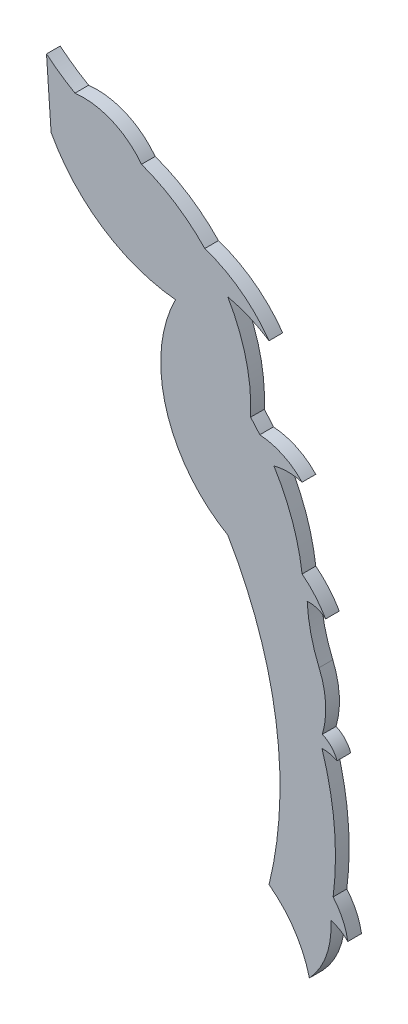
ISO-10303-21;
HEADER;
FILE_DESCRIPTION(('STEP AP214'),'2;1');
FILE_NAME('part.step','',(''),(''),'','','');
FILE_SCHEMA(('AUTOMOTIVE_DESIGN { 1 0 10303 214 1 1 1 1 }'));
ENDSEC;
DATA;
#1=APPLICATION_CONTEXT('core data for automotive mechanical design processes');
#2=APPLICATION_PROTOCOL_DEFINITION('international standard','automotive_design',2000,#1);
#3=PRODUCT_CONTEXT('',#1,'mechanical');
#4=PRODUCT('Part','Part','',(#3));
#5=PRODUCT_RELATED_PRODUCT_CATEGORY('part','',(#4));
#6=PRODUCT_DEFINITION_FORMATION('','',#4);
#7=PRODUCT_DEFINITION_CONTEXT('part definition',#1,'design');
#8=PRODUCT_DEFINITION('design','',#6,#7);
#9=PRODUCT_DEFINITION_SHAPE('','',#8);
#10=(LENGTH_UNIT() NAMED_UNIT(*) SI_UNIT(.MILLI.,.METRE.));
#11=(NAMED_UNIT(*) PLANE_ANGLE_UNIT() SI_UNIT($,.RADIAN.));
#12=(NAMED_UNIT(*) SI_UNIT($,.STERADIAN.) SOLID_ANGLE_UNIT());
#13=UNCERTAINTY_MEASURE_WITH_UNIT(LENGTH_MEASURE(1.E-05),#10,'distance_accuracy_value','');
#14=(GEOMETRIC_REPRESENTATION_CONTEXT(3) GLOBAL_UNCERTAINTY_ASSIGNED_CONTEXT((#13)) GLOBAL_UNIT_ASSIGNED_CONTEXT((#10,
#11,#12)) REPRESENTATION_CONTEXT('',''));
#15=CARTESIAN_POINT('',(0.,0.,0.));
#16=DIRECTION('',(0.,0.,1.));
#17=DIRECTION('',(1.,0.,0.));
#18=AXIS2_PLACEMENT_3D('',#15,#16,#17);
#19=CARTESIAN_POINT('',(-17.3024933003692,110.338418136492,1.524));
#20=DIRECTION('',(0.,0.,-1.));
#21=DIRECTION('',(-1.,0.,0.));
#22=AXIS2_PLACEMENT_3D('',#19,#20,#21);
#23=CYLINDRICAL_SURFACE('',#22,22.4418571303746);
#24=CARTESIAN_POINT('',(-17.3024933003692,110.338418136492,0.));
#25=DIRECTION('',(0.,0.,-1.));
#26=DIRECTION('',(1.,0.,0.));
#27=AXIS2_PLACEMENT_3D('',#24,#25,#26);
#28=CIRCLE('',#27,22.4418571303746);
#29=CARTESIAN_POINT('',(-28.4567762502564,90.8648739461295,0.));
#30=VERTEX_POINT('',#29);
#31=CARTESIAN_POINT('',(-31.6260298544205,93.0620396952532,0.));
#32=VERTEX_POINT('',#31);
#33=EDGE_CURVE('E233',#30,#32,#28,.T.);
#34=ORIENTED_EDGE('',*,*,#33,.T.);
#35=DIRECTION('',(0.,0.,-1.));
#36=VECTOR('',#35,1.);
#37=CARTESIAN_POINT('',(-31.6260298544205,93.0620396952532,1.524));
#38=LINE('',#37,#36);
#39=CARTESIAN_POINT('',(-31.6260298544205,93.0620396952532,1.524));
#40=VERTEX_POINT('',#39);
#41=EDGE_CURVE('E11',#40,#32,#38,.T.);
#42=ORIENTED_EDGE('',*,*,#41,.F.);
#43=CARTESIAN_POINT('',(-17.3024933003692,110.338418136492,1.524));
#44=DIRECTION('',(0.,0.,-1.));
#45=DIRECTION('',(1.,0.,0.));
#46=AXIS2_PLACEMENT_3D('',#43,#44,#45);
#47=CIRCLE('',#46,22.4418571303746);
#48=CARTESIAN_POINT('',(-28.4567762502564,90.8648739461295,1.524));
#49=VERTEX_POINT('',#48);
#50=EDGE_CURVE('E282',#49,#40,#47,.T.);
#51=ORIENTED_EDGE('',*,*,#50,.F.);
#52=DIRECTION('',(0.,0.,-1.));
#53=VECTOR('',#52,1.);
#54=CARTESIAN_POINT('',(-28.4567762502564,90.8648739461295,1.524));
#55=LINE('',#54,#53);
#56=EDGE_CURVE('E229',#49,#30,#55,.T.);
#57=ORIENTED_EDGE('',*,*,#56,.T.);
#58=EDGE_LOOP('',(#34,#42,#51,#57));
#59=FACE_BOUND('',#58,.T.);
#60=ADVANCED_FACE('F35',(#59),#23,.F.);
#61=CARTESIAN_POINT('',(-31.1156545246687,85.7430017860405,1.524));
#62=DIRECTION('',(0.997577515445322,0.0695636448005613,0.));
#63=DIRECTION('',(-0.0695636448005613,0.997577515445322,0.));
#64=AXIS2_PLACEMENT_3D('',#61,#62,#63);
#65=PLANE('',#64);
#66=DIRECTION('',(0.0695636448005613,-0.997577515445322,0.));
#67=VECTOR('',#66,1.);
#68=CARTESIAN_POINT('',(-31.1156545246687,85.7430017860405,0.));
#69=LINE('',#68,#67);
#70=CARTESIAN_POINT('',(-31.1156545246687,85.7430017860405,0.));
#71=VERTEX_POINT('',#70);
#72=EDGE_CURVE('E236',#32,#71,#69,.T.);
#73=ORIENTED_EDGE('',*,*,#72,.T.);
#74=DIRECTION('',(0.,0.,-1.));
#75=VECTOR('',#74,1.);
#76=CARTESIAN_POINT('',(-31.1156545246687,85.7430017860405,1.524));
#77=LINE('',#76,#75);
#78=CARTESIAN_POINT('',(-31.1156545246687,85.7430017860405,1.524));
#79=VERTEX_POINT('',#78);
#80=EDGE_CURVE('E43',#79,#71,#77,.T.);
#81=ORIENTED_EDGE('',*,*,#80,.F.);
#82=DIRECTION('',(0.0695636448005613,-0.997577515445322,0.));
#83=VECTOR('',#82,1.);
#84=CARTESIAN_POINT('',(-31.1156545246687,85.7430017860405,1.524));
#85=LINE('',#84,#83);
#86=EDGE_CURVE('E145',#40,#79,#85,.T.);
#87=ORIENTED_EDGE('',*,*,#86,.F.);
#88=ORIENTED_EDGE('',*,*,#41,.T.);
#89=EDGE_LOOP('',(#73,#81,#87,#88));
#90=FACE_BOUND('',#89,.T.);
#91=ADVANCED_FACE('F425',(#90),#65,.F.);
#92=CARTESIAN_POINT('',(-15.536535131332,94.1502955249123,1.524));
#93=DIRECTION('',(0.,0.,-1.));
#94=DIRECTION('',(-1.,0.,0.));
#95=AXIS2_PLACEMENT_3D('',#92,#93,#94);
#96=CYLINDRICAL_SURFACE('',#95,17.7028683857592);
#97=CARTESIAN_POINT('',(-15.536535131332,94.1502955249123,0.));
#98=DIRECTION('',(0.,0.,1.));
#99=DIRECTION('',(-1.,0.,0.));
#100=AXIS2_PLACEMENT_3D('',#97,#98,#99);
#101=CIRCLE('',#100,17.7028683857592);
#102=CARTESIAN_POINT('',(-17.2533163746224,76.5308684273532,0.));
#103=VERTEX_POINT('',#102);
#104=EDGE_CURVE('E238',#71,#103,#101,.T.);
#105=ORIENTED_EDGE('',*,*,#104,.T.);
#106=DIRECTION('',(0.,0.,-1.));
#107=VECTOR('',#106,1.);
#108=CARTESIAN_POINT('',(-17.2533163746224,76.5308684273532,1.524));
#109=LINE('',#108,#107);
#110=CARTESIAN_POINT('',(-17.2533163746224,76.5308684273532,1.524));
#111=VERTEX_POINT('',#110);
#112=EDGE_CURVE('E340',#111,#103,#109,.T.);
#113=ORIENTED_EDGE('',*,*,#112,.F.);
#114=CARTESIAN_POINT('',(-15.536535131332,94.1502955249123,1.524));
#115=DIRECTION('',(0.,0.,1.));
#116=DIRECTION('',(-1.,0.,0.));
#117=AXIS2_PLACEMENT_3D('',#114,#115,#116);
#118=CIRCLE('',#117,17.7028683857592);
#119=EDGE_CURVE('E348',#79,#111,#118,.T.);
#120=ORIENTED_EDGE('',*,*,#119,.F.);
#121=ORIENTED_EDGE('',*,*,#80,.T.);
#122=EDGE_LOOP('',(#105,#113,#120,#121));
#123=FACE_BOUND('',#122,.T.);
#124=ADVANCED_FACE('F346',(#123),#96,.T.);
#125=CARTESIAN_POINT('',(-3.90752771293424,69.7024363054399,1.524));
#126=DIRECTION('',(0.,0.,-1.));
#127=DIRECTION('',(-1.,0.,0.));
#128=AXIS2_PLACEMENT_3D('',#125,#126,#127);
#129=CYLINDRICAL_SURFACE('',#128,14.9912494557999);
#130=CARTESIAN_POINT('',(-3.90752771293424,69.7024363054399,0.));
#131=DIRECTION('',(0.,0.,1.));
#132=DIRECTION('',(-1.,0.,0.));
#133=AXIS2_PLACEMENT_3D('',#130,#131,#132);
#134=CIRCLE('',#133,14.9912494557999);
#135=CARTESIAN_POINT('',(-11.4344636454671,56.7377613880513,0.));
#136=VERTEX_POINT('',#135);
#137=EDGE_CURVE('E240',#103,#136,#134,.T.);
#138=ORIENTED_EDGE('',*,*,#137,.T.);
#139=DIRECTION('',(0.,0.,-1.));
#140=VECTOR('',#139,1.);
#141=CARTESIAN_POINT('',(-11.4344636454671,56.7377613880513,1.524));
#142=LINE('',#141,#140);
#143=CARTESIAN_POINT('',(-11.4344636454671,56.7377613880513,1.524));
#144=VERTEX_POINT('',#143);
#145=EDGE_CURVE('E337',#144,#136,#142,.T.);
#146=ORIENTED_EDGE('',*,*,#145,.F.);
#147=CARTESIAN_POINT('',(-3.90752771293424,69.7024363054399,1.524));
#148=DIRECTION('',(0.,0.,1.));
#149=DIRECTION('',(-1.,0.,0.));
#150=AXIS2_PLACEMENT_3D('',#147,#148,#149);
#151=CIRCLE('',#150,14.9912494557999);
#152=EDGE_CURVE('E366',#111,#144,#151,.T.);
#153=ORIENTED_EDGE('',*,*,#152,.F.);
#154=ORIENTED_EDGE('',*,*,#112,.T.);
#155=EDGE_LOOP('',(#138,#146,#153,#154));
#156=FACE_BOUND('',#155,.T.);
#157=ADVANCED_FACE('F357',(#156),#129,.T.);
#158=CARTESIAN_POINT('',(-47.7068235865825,35.3788673598282,1.524));
#159=DIRECTION('',(0.,0.,-1.));
#160=DIRECTION('',(-1.,0.,0.));
#161=AXIS2_PLACEMENT_3D('',#158,#159,#160);
#162=CYLINDRICAL_SURFACE('',#161,42.0937816049675);
#163=CARTESIAN_POINT('',(-47.7068235865825,35.3788673598282,0.));
#164=DIRECTION('',(0.,0.,-1.));
#165=DIRECTION('',(1.,0.,0.));
#166=AXIS2_PLACEMENT_3D('',#163,#164,#165);
#167=CIRCLE('',#166,42.0937816049675);
#168=CARTESIAN_POINT('',(-6.8345317639017,25.3119805039865,0.));
#169=VERTEX_POINT('',#168);
#170=EDGE_CURVE('E242',#136,#169,#167,.T.);
#171=ORIENTED_EDGE('',*,*,#170,.T.);
#172=DIRECTION('',(0.,0.,-1.));
#173=VECTOR('',#172,1.);
#174=CARTESIAN_POINT('',(-6.8345317639017,25.3119805039865,1.524));
#175=LINE('',#174,#173);
#176=CARTESIAN_POINT('',(-6.8345317639017,25.3119805039865,1.524));
#177=VERTEX_POINT('',#176);
#178=EDGE_CURVE('E334',#177,#169,#175,.T.);
#179=ORIENTED_EDGE('',*,*,#178,.F.);
#180=CARTESIAN_POINT('',(-47.7068235865825,35.3788673598282,1.524));
#181=DIRECTION('',(0.,0.,-1.));
#182=DIRECTION('',(1.,0.,0.));
#183=AXIS2_PLACEMENT_3D('',#180,#181,#182);
#184=CIRCLE('',#183,42.0937816049675);
#185=EDGE_CURVE('E363',#144,#177,#184,.T.);
#186=ORIENTED_EDGE('',*,*,#185,.F.);
#187=ORIENTED_EDGE('',*,*,#145,.T.);
#188=EDGE_LOOP('',(#171,#179,#186,#187));
#189=FACE_BOUND('',#188,.T.);
#190=ADVANCED_FACE('F361',(#189),#162,.F.);
#191=CARTESIAN_POINT('',(-13.9944501828131,15.6771297998431,1.524));
#192=DIRECTION('',(0.,0.,-1.));
#193=DIRECTION('',(-1.,0.,0.));
#194=AXIS2_PLACEMENT_3D('',#191,#192,#193);
#195=CYLINDRICAL_SURFACE('',#194,12.0039485110775);
#196=CARTESIAN_POINT('',(-13.9944501828131,15.6771297998431,0.));
#197=DIRECTION('',(0.,0.,-1.));
#198=DIRECTION('',(1.,0.,0.));
#199=AXIS2_PLACEMENT_3D('',#196,#197,#198);
#200=CIRCLE('',#199,12.0039485110775);
#201=CARTESIAN_POINT('',(-2.33938911909727,18.5501650341649,0.));
#202=VERTEX_POINT('',#201);
#203=EDGE_CURVE('E244',#169,#202,#200,.T.);
#204=ORIENTED_EDGE('',*,*,#203,.T.);
#205=DIRECTION('',(0.,0.,-1.));
#206=VECTOR('',#205,1.);
#207=CARTESIAN_POINT('',(-2.33938911909727,18.5501650341649,1.524));
#208=LINE('',#207,#206);
#209=CARTESIAN_POINT('',(-2.33938911909727,18.5501650341649,1.524));
#210=VERTEX_POINT('',#209);
#211=EDGE_CURVE('E331',#210,#202,#208,.T.);
#212=ORIENTED_EDGE('',*,*,#211,.F.);
#213=CARTESIAN_POINT('',(-13.9944501828131,15.6771297998431,1.524));
#214=DIRECTION('',(0.,0.,-1.));
#215=DIRECTION('',(1.,0.,0.));
#216=AXIS2_PLACEMENT_3D('',#213,#214,#215);
#217=CIRCLE('',#216,12.0039485110775);
#218=EDGE_CURVE('E365',#177,#210,#217,.T.);
#219=ORIENTED_EDGE('',*,*,#218,.F.);
#220=ORIENTED_EDGE('',*,*,#178,.T.);
#221=EDGE_LOOP('',(#204,#212,#219,#220));
#222=FACE_BOUND('',#221,.T.);
#223=ADVANCED_FACE('F438',(#222),#195,.F.);
#224=CARTESIAN_POINT('',(-8.89107414495909,24.6666613876007,1.524));
#225=DIRECTION('',(0.,0.,-1.));
#226=DIRECTION('',(-1.,0.,0.));
#227=AXIS2_PLACEMENT_3D('',#224,#225,#226);
#228=CYLINDRICAL_SURFACE('',#227,8.96304101963696);
#229=CARTESIAN_POINT('',(-8.89107414495909,24.6666613876007,0.));
#230=DIRECTION('',(0.,0.,1.));
#231=DIRECTION('',(-1.,0.,0.));
#232=AXIS2_PLACEMENT_3D('',#229,#230,#231);
#233=CIRCLE('',#232,8.96304101963696);
#234=CARTESIAN_POINT('',(0.0487059170850342,25.3119805039865,0.));
#235=VERTEX_POINT('',#234);
#236=EDGE_CURVE('E246',#202,#235,#233,.T.);
#237=ORIENTED_EDGE('',*,*,#236,.T.);
#238=DIRECTION('',(0.,0.,-1.));
#239=VECTOR('',#238,1.);
#240=CARTESIAN_POINT('',(0.0487059170850342,25.3119805039865,1.524));
#241=LINE('',#240,#239);
#242=CARTESIAN_POINT('',(0.0487059170850342,25.3119805039865,1.524));
#243=VERTEX_POINT('',#242);
#244=EDGE_CURVE('E328',#243,#235,#241,.T.);
#245=ORIENTED_EDGE('',*,*,#244,.F.);
#246=CARTESIAN_POINT('',(-8.89107414495909,24.6666613876007,1.524));
#247=DIRECTION('',(0.,0.,1.));
#248=DIRECTION('',(-1.,0.,0.));
#249=AXIS2_PLACEMENT_3D('',#246,#247,#248);
#250=CIRCLE('',#249,8.96304101963696);
#251=EDGE_CURVE('E368',#210,#243,#250,.T.);
#252=ORIENTED_EDGE('',*,*,#251,.F.);
#253=ORIENTED_EDGE('',*,*,#211,.T.);
#254=EDGE_LOOP('',(#237,#245,#252,#253));
#255=FACE_BOUND('',#254,.T.);
#256=ADVANCED_FACE('F441',(#255),#228,.T.);
#257=CARTESIAN_POINT('',(-1.01856859330376,21.3075940898435,1.524));
#258=DIRECTION('',(0.,0.,-1.));
#259=DIRECTION('',(-1.,0.,0.));
#260=AXIS2_PLACEMENT_3D('',#257,#258,#259);
#261=CYLINDRICAL_SURFACE('',#260,4.14417487979197);
#262=CARTESIAN_POINT('',(-1.01856859330376,21.3075940898435,0.));
#263=DIRECTION('',(0.,0.,-1.));
#264=DIRECTION('',(1.,0.,0.));
#265=AXIS2_PLACEMENT_3D('',#262,#263,#264);
#266=CIRCLE('',#265,4.14417487979197);
#267=CARTESIAN_POINT('',(1.94072364464759,24.2087619382624,0.));
#268=VERTEX_POINT('',#267);
#269=EDGE_CURVE('E248',#235,#268,#266,.T.);
#270=ORIENTED_EDGE('',*,*,#269,.T.);
#271=DIRECTION('',(0.,0.,-1.));
#272=VECTOR('',#271,1.);
#273=CARTESIAN_POINT('',(1.94072364464759,24.2087619382624,1.524));
#274=LINE('',#273,#272);
#275=CARTESIAN_POINT('',(1.94072364464759,24.2087619382624,1.524));
#276=VERTEX_POINT('',#275);
#277=EDGE_CURVE('E325',#276,#268,#274,.T.);
#278=ORIENTED_EDGE('',*,*,#277,.F.);
#279=CARTESIAN_POINT('',(-1.01856859330376,21.3075940898435,1.524));
#280=DIRECTION('',(0.,0.,-1.));
#281=DIRECTION('',(1.,0.,0.));
#282=AXIS2_PLACEMENT_3D('',#279,#280,#281);
#283=CIRCLE('',#282,4.14417487979197);
#284=EDGE_CURVE('E374',#243,#276,#283,.T.);
#285=ORIENTED_EDGE('',*,*,#284,.F.);
#286=ORIENTED_EDGE('',*,*,#244,.T.);
#287=EDGE_LOOP('',(#270,#278,#285,#286));
#288=FACE_BOUND('',#287,.T.);
#289=ADVANCED_FACE('F445',(#288),#261,.F.);
#290=CARTESIAN_POINT('',(-5.07908944021825,23.0362233272412,1.524));
#291=DIRECTION('',(0.,0.,-1.));
#292=DIRECTION('',(-1.,0.,0.));
#293=AXIS2_PLACEMENT_3D('',#290,#291,#292);
#294=CYLINDRICAL_SURFACE('',#293,7.11706558497174);
#295=CARTESIAN_POINT('',(-5.07908944021825,23.0362233272412,0.));
#296=DIRECTION('',(0.,0.,1.));
#297=DIRECTION('',(-1.,0.,0.));
#298=AXIS2_PLACEMENT_3D('',#295,#296,#297);
#299=CIRCLE('',#298,7.11706558497174);
#300=CARTESIAN_POINT('',(0.303865797754205,27.692017077696,0.));
#301=VERTEX_POINT('',#300);
#302=EDGE_CURVE('E250',#268,#301,#299,.T.);
#303=ORIENTED_EDGE('',*,*,#302,.T.);
#304=DIRECTION('',(0.,0.,-1.));
#305=VECTOR('',#304,1.);
#306=CARTESIAN_POINT('',(0.303865797754205,27.692017077696,1.524));
#307=LINE('',#306,#305);
#308=CARTESIAN_POINT('',(0.303865797754205,27.692017077696,1.524));
#309=VERTEX_POINT('',#308);
#310=EDGE_CURVE('E322',#309,#301,#307,.T.);
#311=ORIENTED_EDGE('',*,*,#310,.F.);
#312=CARTESIAN_POINT('',(-5.07908944021825,23.0362233272412,1.524));
#313=DIRECTION('',(0.,0.,1.));
#314=DIRECTION('',(-1.,0.,0.));
#315=AXIS2_PLACEMENT_3D('',#312,#313,#314);
#316=CIRCLE('',#315,7.11706558497174);
#317=EDGE_CURVE('E376',#276,#309,#316,.T.);
#318=ORIENTED_EDGE('',*,*,#317,.F.);
#319=ORIENTED_EDGE('',*,*,#277,.T.);
#320=EDGE_LOOP('',(#303,#311,#318,#319));
#321=FACE_BOUND('',#320,.T.);
#322=ADVANCED_FACE('F449',(#321),#294,.T.);
#323=CARTESIAN_POINT('',(-31.0648704485611,31.7601799505042,1.524));
#324=DIRECTION('',(0.,0.,-1.));
#325=DIRECTION('',(-1.,0.,0.));
#326=AXIS2_PLACEMENT_3D('',#323,#324,#325);
#327=CYLINDRICAL_SURFACE('',#326,31.6314331456953);
#328=CARTESIAN_POINT('',(-31.0648704485611,31.7601799505042,0.));
#329=DIRECTION('',(0.,0.,1.));
#330=DIRECTION('',(-1.,0.,0.));
#331=AXIS2_PLACEMENT_3D('',#328,#329,#330);
#332=CIRCLE('',#331,31.6314331456953);
#333=CARTESIAN_POINT('',(-0.941146572103171,41.4094712543,0.));
#334=VERTEX_POINT('',#333);
#335=EDGE_CURVE('E252',#301,#334,#332,.T.);
#336=ORIENTED_EDGE('',*,*,#335,.T.);
#337=DIRECTION('',(0.,0.,-1.));
#338=VECTOR('',#337,1.);
#339=CARTESIAN_POINT('',(-0.941146572103171,41.4094712543,1.524));
#340=LINE('',#339,#338);
#341=CARTESIAN_POINT('',(-0.941146572103171,41.4094712543,1.524));
#342=VERTEX_POINT('',#341);
#343=EDGE_CURVE('E319',#342,#334,#340,.T.);
#344=ORIENTED_EDGE('',*,*,#343,.F.);
#345=CARTESIAN_POINT('',(-31.0648704485611,31.7601799505042,1.524));
#346=DIRECTION('',(0.,0.,1.));
#347=DIRECTION('',(-1.,0.,0.));
#348=AXIS2_PLACEMENT_3D('',#345,#346,#347);
#349=CIRCLE('',#348,31.6314331456953);
#350=EDGE_CURVE('E378',#309,#342,#349,.T.);
#351=ORIENTED_EDGE('',*,*,#350,.F.);
#352=ORIENTED_EDGE('',*,*,#310,.T.);
#353=EDGE_LOOP('',(#336,#344,#351,#352));
#354=FACE_BOUND('',#353,.T.);
#355=ADVANCED_FACE('F453',(#354),#327,.T.);
#356=CARTESIAN_POINT('',(-0.893428223070229,37.5181940332144,1.524));
#357=DIRECTION('',(0.,0.,-1.));
#358=DIRECTION('',(-1.,0.,0.));
#359=AXIS2_PLACEMENT_3D('',#356,#357,#358);
#360=CYLINDRICAL_SURFACE('',#359,3.89156979279235);
#361=CARTESIAN_POINT('',(-0.893428223070229,37.5181940332144,0.));
#362=DIRECTION('',(0.,0.,-1.));
#363=DIRECTION('',(1.,0.,0.));
#364=AXIS2_PLACEMENT_3D('',#361,#362,#363);
#365=CIRCLE('',#364,3.89156979279235);
#366=CARTESIAN_POINT('',(0.742668625515866,41.049129115345,0.));
#367=VERTEX_POINT('',#366);
#368=EDGE_CURVE('E254',#334,#367,#365,.T.);
#369=ORIENTED_EDGE('',*,*,#368,.T.);
#370=DIRECTION('',(0.,0.,-1.));
#371=VECTOR('',#370,1.);
#372=CARTESIAN_POINT('',(0.742668625515866,41.049129115345,1.524));
#373=LINE('',#372,#371);
#374=CARTESIAN_POINT('',(0.742668625515866,41.049129115345,1.524));
#375=VERTEX_POINT('',#374);
#376=EDGE_CURVE('E316',#375,#367,#373,.T.);
#377=ORIENTED_EDGE('',*,*,#376,.F.);
#378=CARTESIAN_POINT('',(-0.893428223070229,37.5181940332144,1.524));
#379=DIRECTION('',(0.,0.,-1.));
#380=DIRECTION('',(1.,0.,0.));
#381=AXIS2_PLACEMENT_3D('',#378,#379,#380);
#382=CIRCLE('',#381,3.89156979279235);
#383=EDGE_CURVE('E380',#342,#375,#382,.T.);
#384=ORIENTED_EDGE('',*,*,#383,.F.);
#385=ORIENTED_EDGE('',*,*,#343,.T.);
#386=EDGE_LOOP('',(#369,#377,#384,#385));
#387=FACE_BOUND('',#386,.T.);
#388=ADVANCED_FACE('F457',(#387),#360,.F.);
#389=CARTESIAN_POINT('',(-2.1273885005661,39.977980042309,1.524));
#390=DIRECTION('',(0.,0.,-1.));
#391=DIRECTION('',(-1.,0.,0.));
#392=AXIS2_PLACEMENT_3D('',#389,#390,#391);
#393=CYLINDRICAL_SURFACE('',#392,3.06342753197131);
#394=CARTESIAN_POINT('',(-2.1273885005661,39.977980042309,0.));
#395=DIRECTION('',(0.,0.,1.));
#396=DIRECTION('',(-1.,0.,0.));
#397=AXIS2_PLACEMENT_3D('',#394,#395,#396);
#398=CIRCLE('',#397,3.06342753197131);
#399=CARTESIAN_POINT('',(-0.893428223070066,42.7818934284894,0.));
#400=VERTEX_POINT('',#399);
#401=EDGE_CURVE('E256',#367,#400,#398,.T.);
#402=ORIENTED_EDGE('',*,*,#401,.T.);
#403=DIRECTION('',(0.,0.,-1.));
#404=VECTOR('',#403,1.);
#405=CARTESIAN_POINT('',(-0.893428223070066,42.7818934284894,1.524));
#406=LINE('',#405,#404);
#407=CARTESIAN_POINT('',(-0.893428223070066,42.7818934284894,1.524));
#408=VERTEX_POINT('',#407);
#409=EDGE_CURVE('E313',#408,#400,#406,.T.);
#410=ORIENTED_EDGE('',*,*,#409,.F.);
#411=CARTESIAN_POINT('',(-2.1273885005661,39.977980042309,1.524));
#412=DIRECTION('',(0.,0.,1.));
#413=DIRECTION('',(-1.,0.,0.));
#414=AXIS2_PLACEMENT_3D('',#411,#412,#413);
#415=CIRCLE('',#414,3.06342753197131);
#416=EDGE_CURVE('E382',#375,#408,#415,.T.);
#417=ORIENTED_EDGE('',*,*,#416,.F.);
#418=ORIENTED_EDGE('',*,*,#376,.T.);
#419=EDGE_LOOP('',(#402,#410,#417,#418));
#420=FACE_BOUND('',#419,.T.);
#421=ADVANCED_FACE('F461',(#420),#393,.T.);
#422=CARTESIAN_POINT('',(-9.77457463909335,45.397743851005,1.524));
#423=DIRECTION('',(0.,0.,-1.));
#424=DIRECTION('',(-1.,0.,0.));
#425=AXIS2_PLACEMENT_3D('',#422,#423,#424);
#426=CYLINDRICAL_SURFACE('',#425,9.25837108220547);
#427=CARTESIAN_POINT('',(-9.77457463909335,45.397743851005,0.));
#428=DIRECTION('',(0.,0.,1.));
#429=DIRECTION('',(-1.,0.,0.));
#430=AXIS2_PLACEMENT_3D('',#427,#428,#429);
#431=CIRCLE('',#430,9.25837108220547);
#432=CARTESIAN_POINT('',(-1.25852369652675,49.0301413291769,0.));
#433=VERTEX_POINT('',#432);
#434=EDGE_CURVE('E258',#400,#433,#431,.T.);
#435=ORIENTED_EDGE('',*,*,#434,.T.);
#436=DIRECTION('',(0.,0.,-1.));
#437=VECTOR('',#436,1.);
#438=CARTESIAN_POINT('',(-1.25852369652675,49.0301413291769,1.524));
#439=LINE('',#438,#437);
#440=CARTESIAN_POINT('',(-1.25852369652675,49.0301413291769,1.524));
#441=VERTEX_POINT('',#440);
#442=EDGE_CURVE('E310',#441,#433,#439,.T.);
#443=ORIENTED_EDGE('',*,*,#442,.F.);
#444=CARTESIAN_POINT('',(-9.77457463909335,45.397743851005,1.524));
#445=DIRECTION('',(0.,0.,1.));
#446=DIRECTION('',(-1.,0.,0.));
#447=AXIS2_PLACEMENT_3D('',#444,#445,#446);
#448=CIRCLE('',#447,9.25837108220547);
#449=EDGE_CURVE('E384',#408,#441,#448,.T.);
#450=ORIENTED_EDGE('',*,*,#449,.F.);
#451=ORIENTED_EDGE('',*,*,#409,.T.);
#452=EDGE_LOOP('',(#435,#443,#450,#451));
#453=FACE_BOUND('',#452,.T.);
#454=ADVANCED_FACE('F465',(#453),#426,.T.);
#455=CARTESIAN_POINT('',(14.2045890021924,55.625706803161,1.524));
#456=DIRECTION('',(0.,0.,-1.));
#457=DIRECTION('',(-1.,0.,0.));
#458=AXIS2_PLACEMENT_3D('',#455,#456,#457);
#459=CYLINDRICAL_SURFACE('',#458,16.8109886162269);
#460=CARTESIAN_POINT('',(14.2045890021924,55.625706803161,0.));
#461=DIRECTION('',(0.,0.,-1.));
#462=DIRECTION('',(1.,0.,0.));
#463=AXIS2_PLACEMENT_3D('',#460,#461,#462);
#464=CIRCLE('',#463,16.8109886162269);
#465=CARTESIAN_POINT('',(-2.58443242218058,54.7665805802723,0.));
#466=VERTEX_POINT('',#465);
#467=EDGE_CURVE('E261',#433,#466,#464,.T.);
#468=ORIENTED_EDGE('',*,*,#467,.T.);
#469=DIRECTION('',(0.,0.,-1.));
#470=VECTOR('',#469,1.);
#471=CARTESIAN_POINT('',(-2.58443242218058,54.7665805802723,1.524));
#472=LINE('',#471,#470);
#473=CARTESIAN_POINT('',(-2.58443242218058,54.7665805802723,1.524));
#474=VERTEX_POINT('',#473);
#475=EDGE_CURVE('E307',#474,#466,#472,.T.);
#476=ORIENTED_EDGE('',*,*,#475,.F.);
#477=CARTESIAN_POINT('',(14.2045890021717,55.6257068031559,1.524));
#478=DIRECTION('',(0.,0.,-1.));
#479=DIRECTION('',(1.,0.,0.));
#480=AXIS2_PLACEMENT_3D('',#477,#478,#479);
#481=CIRCLE('',#480,16.8109886162056);
#482=EDGE_CURVE('E386',#441,#474,#481,.T.);
#483=ORIENTED_EDGE('',*,*,#482,.F.);
#484=ORIENTED_EDGE('',*,*,#442,.T.);
#485=EDGE_LOOP('',(#468,#476,#483,#484));
#486=FACE_BOUND('',#485,.T.);
#487=ADVANCED_FACE('F469',(#486),#459,.F.);
#488=CARTESIAN_POINT('',(-2.31316757840683,52.1359332619856,1.524));
#489=DIRECTION('',(0.,0.,-1.));
#490=DIRECTION('',(-1.,0.,0.));
#491=AXIS2_PLACEMENT_3D('',#488,#489,#490);
#492=CYLINDRICAL_SURFACE('',#491,2.64459636403676);
#493=CARTESIAN_POINT('',(-2.31316757840683,52.1359332619856,0.));
#494=DIRECTION('',(0.,0.,-1.));
#495=DIRECTION('',(1.,0.,0.));
#496=AXIS2_PLACEMENT_3D('',#493,#494,#495);
#497=CIRCLE('',#496,2.64459636403676);
#498=CARTESIAN_POINT('',(-0.531968435184138,54.090727251351,0.));
#499=VERTEX_POINT('',#498);
#500=EDGE_CURVE('E263',#466,#499,#497,.T.);
#501=ORIENTED_EDGE('',*,*,#500,.T.);
#502=DIRECTION('',(0.,0.,-1.));
#503=VECTOR('',#502,1.);
#504=CARTESIAN_POINT('',(-0.531968435184138,54.090727251351,1.524));
#505=LINE('',#504,#503);
#506=CARTESIAN_POINT('',(-0.531968435184138,54.090727251351,1.524));
#507=VERTEX_POINT('',#506);
#508=EDGE_CURVE('E304',#507,#499,#505,.T.);
#509=ORIENTED_EDGE('',*,*,#508,.F.);
#510=CARTESIAN_POINT('',(-2.31316757840683,52.1359332619856,1.524));
#511=DIRECTION('',(0.,0.,-1.));
#512=DIRECTION('',(1.,0.,0.));
#513=AXIS2_PLACEMENT_3D('',#510,#511,#512);
#514=CIRCLE('',#513,2.64459636403676);
#515=EDGE_CURVE('E388',#474,#507,#514,.T.);
#516=ORIENTED_EDGE('',*,*,#515,.F.);
#517=ORIENTED_EDGE('',*,*,#475,.T.);
#518=EDGE_LOOP('',(#501,#509,#516,#517));
#519=FACE_BOUND('',#518,.T.);
#520=ADVANCED_FACE('F473',(#519),#492,.F.);
#521=CARTESIAN_POINT('',(-9.64317433097189,48.8594499835328,1.524));
#522=DIRECTION('',(0.,0.,-1.));
#523=DIRECTION('',(-1.,0.,0.));
#524=AXIS2_PLACEMENT_3D('',#521,#522,#523);
#525=CYLINDRICAL_SURFACE('',#524,10.5062045824469);
#526=CARTESIAN_POINT('',(-9.64317433097189,48.8594499835328,0.));
#527=DIRECTION('',(0.,0.,1.));
#528=DIRECTION('',(-1.,0.,0.));
#529=AXIS2_PLACEMENT_3D('',#526,#527,#528);
#530=CIRCLE('',#529,10.5062045824469);
#531=CARTESIAN_POINT('',(-3.15070988526024,57.1194887334055,0.));
#532=VERTEX_POINT('',#531);
#533=EDGE_CURVE('E265',#499,#532,#530,.T.);
#534=ORIENTED_EDGE('',*,*,#533,.T.);
#535=DIRECTION('',(0.,0.,-1.));
#536=VECTOR('',#535,1.);
#537=CARTESIAN_POINT('',(-3.15070988526024,57.1194887334055,1.524));
#538=LINE('',#537,#536);
#539=CARTESIAN_POINT('',(-3.15070988526024,57.1194887334055,1.524));
#540=VERTEX_POINT('',#539);
#541=EDGE_CURVE('E301',#540,#532,#538,.T.);
#542=ORIENTED_EDGE('',*,*,#541,.F.);
#543=CARTESIAN_POINT('',(-9.64317433097189,48.8594499835328,1.524));
#544=DIRECTION('',(0.,0.,1.));
#545=DIRECTION('',(-1.,0.,0.));
#546=AXIS2_PLACEMENT_3D('',#543,#544,#545);
#547=CIRCLE('',#546,10.5062045824469);
#548=EDGE_CURVE('E390',#507,#540,#547,.T.);
#549=ORIENTED_EDGE('',*,*,#548,.F.);
#550=ORIENTED_EDGE('',*,*,#508,.T.);
#551=EDGE_LOOP('',(#534,#542,#549,#550));
#552=FACE_BOUND('',#551,.T.);
#553=ADVANCED_FACE('F477',(#552),#525,.T.);
#554=CARTESIAN_POINT('',(-25.0332112363326,54.3458278928265,1.524));
#555=DIRECTION('',(0.,0.,-1.));
#556=DIRECTION('',(-1.,0.,0.));
#557=AXIS2_PLACEMENT_3D('',#554,#555,#556);
#558=CYLINDRICAL_SURFACE('',#557,22.0575850862746);
#559=CARTESIAN_POINT('',(-25.0332112363326,54.3458278928265,0.));
#560=DIRECTION('',(0.,0.,1.));
#561=DIRECTION('',(-1.,0.,0.));
#562=AXIS2_PLACEMENT_3D('',#559,#560,#561);
#563=CIRCLE('',#562,22.0575850862746);
#564=CARTESIAN_POINT('',(-6.291364356868,65.9768310905282,0.));
#565=VERTEX_POINT('',#564);
#566=EDGE_CURVE('E267',#532,#565,#563,.T.);
#567=ORIENTED_EDGE('',*,*,#566,.T.);
#568=DIRECTION('',(0.,0.,-1.));
#569=VECTOR('',#568,1.);
#570=CARTESIAN_POINT('',(-6.291364356868,65.9768310905282,1.524));
#571=LINE('',#570,#569);
#572=CARTESIAN_POINT('',(-6.291364356868,65.9768310905282,1.524));
#573=VERTEX_POINT('',#572);
#574=EDGE_CURVE('E298',#573,#565,#571,.T.);
#575=ORIENTED_EDGE('',*,*,#574,.F.);
#576=CARTESIAN_POINT('',(-25.0332112363326,54.3458278928265,1.524));
#577=DIRECTION('',(0.,0.,1.));
#578=DIRECTION('',(-1.,0.,0.));
#579=AXIS2_PLACEMENT_3D('',#576,#577,#578);
#580=CIRCLE('',#579,22.0575850862746);
#581=EDGE_CURVE('E392',#540,#573,#580,.T.);
#582=ORIENTED_EDGE('',*,*,#581,.F.);
#583=ORIENTED_EDGE('',*,*,#541,.T.);
#584=EDGE_LOOP('',(#567,#575,#582,#583));
#585=FACE_BOUND('',#584,.T.);
#586=ADVANCED_FACE('F481',(#585),#558,.T.);
#587=CARTESIAN_POINT('',(-4.72103712106412,60.2455165620382,1.524));
#588=DIRECTION('',(0.,0.,-1.));
#589=DIRECTION('',(-1.,0.,0.));
#590=AXIS2_PLACEMENT_3D('',#587,#588,#589);
#591=CYLINDRICAL_SURFACE('',#590,5.94254944043283);
#592=CARTESIAN_POINT('',(-4.72103712106412,60.2455165620382,0.));
#593=DIRECTION('',(0.,0.,-1.));
#594=DIRECTION('',(1.,0.,0.));
#595=AXIS2_PLACEMENT_3D('',#592,#593,#594);
#596=CIRCLE('',#595,5.94254944043283);
#597=CARTESIAN_POINT('',(-3.15070988526024,65.9768310905282,0.));
#598=VERTEX_POINT('',#597);
#599=EDGE_CURVE('E269',#565,#598,#596,.T.);
#600=ORIENTED_EDGE('',*,*,#599,.T.);
#601=DIRECTION('',(0.,0.,-1.));
#602=VECTOR('',#601,1.);
#603=CARTESIAN_POINT('',(-3.15070988526024,65.9768310905282,1.524));
#604=LINE('',#603,#602);
#605=CARTESIAN_POINT('',(-3.15070988526024,65.9768310905282,1.524));
#606=VERTEX_POINT('',#605);
#607=EDGE_CURVE('E295',#606,#598,#604,.T.);
#608=ORIENTED_EDGE('',*,*,#607,.F.);
#609=CARTESIAN_POINT('',(-4.72103712106412,60.2455165620382,1.524));
#610=DIRECTION('',(0.,0.,-1.));
#611=DIRECTION('',(1.,0.,0.));
#612=AXIS2_PLACEMENT_3D('',#609,#610,#611);
#613=CIRCLE('',#612,5.94254944043283);
#614=EDGE_CURVE('E394',#573,#606,#613,.T.);
#615=ORIENTED_EDGE('',*,*,#614,.F.);
#616=ORIENTED_EDGE('',*,*,#574,.T.);
#617=EDGE_LOOP('',(#600,#608,#615,#616));
#618=FACE_BOUND('',#617,.T.);
#619=ADVANCED_FACE('F485',(#618),#591,.F.);
#620=CARTESIAN_POINT('',(-8.33418737302962,61.0836940188721,1.524));
#621=DIRECTION('',(0.,0.,-1.));
#622=DIRECTION('',(-1.,0.,0.));
#623=AXIS2_PLACEMENT_3D('',#620,#621,#622);
#624=CYLINDRICAL_SURFACE('',#623,7.12819958111634);
#625=CARTESIAN_POINT('',(-8.33418737302962,61.0836940188721,0.));
#626=DIRECTION('',(0.,0.,1.));
#627=DIRECTION('',(-1.,0.,0.));
#628=AXIS2_PLACEMENT_3D('',#625,#626,#627);
#629=CIRCLE('',#628,7.12819958111634);
#630=CARTESIAN_POINT('',(-7.86653028454092,68.1965363562091,0.));
#631=VERTEX_POINT('',#630);
#632=EDGE_CURVE('E271',#598,#631,#629,.T.);
#633=ORIENTED_EDGE('',*,*,#632,.T.);
#634=DIRECTION('',(0.,0.,-1.));
#635=VECTOR('',#634,1.);
#636=CARTESIAN_POINT('',(-7.86653028454092,68.1965363562091,1.524));
#637=LINE('',#636,#635);
#638=CARTESIAN_POINT('',(-7.86653028454092,68.1965363562091,1.524));
#639=VERTEX_POINT('',#638);
#640=EDGE_CURVE('E292',#639,#631,#637,.T.);
#641=ORIENTED_EDGE('',*,*,#640,.F.);
#642=CARTESIAN_POINT('',(-8.33418737302962,61.0836940188721,1.524));
#643=DIRECTION('',(0.,0.,1.));
#644=DIRECTION('',(-1.,0.,0.));
#645=AXIS2_PLACEMENT_3D('',#642,#643,#644);
#646=CIRCLE('',#645,7.12819958111634);
#647=EDGE_CURVE('E396',#606,#639,#646,.T.);
#648=ORIENTED_EDGE('',*,*,#647,.F.);
#649=ORIENTED_EDGE('',*,*,#607,.T.);
#650=EDGE_LOOP('',(#633,#641,#648,#649));
#651=FACE_BOUND('',#650,.T.);
#652=ADVANCED_FACE('F489',(#651),#624,.T.);
#653=CARTESIAN_POINT('',(-25.0332112363658,54.3458278927917,1.524));
#654=DIRECTION('',(0.,0.,-1.));
#655=DIRECTION('',(-1.,0.,0.));
#656=AXIS2_PLACEMENT_3D('',#653,#654,#655);
#657=CYLINDRICAL_SURFACE('',#656,22.0575850863219);
#658=CARTESIAN_POINT('',(-25.0332112363658,54.3458278927917,0.));
#659=DIRECTION('',(0.,0.,1.));
#660=DIRECTION('',(-1.,0.,0.));
#661=AXIS2_PLACEMENT_3D('',#658,#659,#660);
#662=CIRCLE('',#661,22.0575850863219);
#663=CARTESIAN_POINT('',(-8.89107414495884,69.3780755611397,0.));
#664=VERTEX_POINT('',#663);
#665=EDGE_CURVE('E273',#631,#664,#662,.T.);
#666=ORIENTED_EDGE('',*,*,#665,.T.);
#667=DIRECTION('',(0.,0.,-1.));
#668=VECTOR('',#667,1.);
#669=CARTESIAN_POINT('',(-8.89107414495884,69.3780755611397,1.524));
#670=LINE('',#669,#668);
#671=CARTESIAN_POINT('',(-8.89107414495884,69.3780755611397,1.524));
#672=VERTEX_POINT('',#671);
#673=EDGE_CURVE('E289',#672,#664,#670,.T.);
#674=ORIENTED_EDGE('',*,*,#673,.F.);
#675=CARTESIAN_POINT('',(-25.0332112363658,54.3458278927917,1.524));
#676=DIRECTION('',(0.,0.,1.));
#677=DIRECTION('',(-1.,0.,0.));
#678=AXIS2_PLACEMENT_3D('',#675,#676,#677);
#679=CIRCLE('',#678,22.0575850863219);
#680=EDGE_CURVE('E398',#639,#672,#679,.T.);
#681=ORIENTED_EDGE('',*,*,#680,.F.);
#682=ORIENTED_EDGE('',*,*,#640,.T.);
#683=EDGE_LOOP('',(#666,#674,#681,#682));
#684=FACE_BOUND('',#683,.T.);
#685=ADVANCED_FACE('F493',(#684),#657,.T.);
#686=CARTESIAN_POINT('',(-27.3525121713193,70.3249845333272,1.524));
#687=DIRECTION('',(0.,0.,-1.));
#688=DIRECTION('',(-1.,0.,0.));
#689=AXIS2_PLACEMENT_3D('',#686,#687,#688);
#690=CYLINDRICAL_SURFACE('',#689,18.485706115882);
#691=CARTESIAN_POINT('',(-27.3525121713193,70.3249845333272,0.));
#692=DIRECTION('',(0.,0.,1.));
#693=DIRECTION('',(-1.,0.,0.));
#694=AXIS2_PLACEMENT_3D('',#691,#692,#693);
#695=CIRCLE('',#694,18.485706115882);
#696=CARTESIAN_POINT('',(-11.4344636454671,79.7237643334594,0.));
#697=VERTEX_POINT('',#696);
#698=EDGE_CURVE('E275',#664,#697,#695,.T.);
#699=ORIENTED_EDGE('',*,*,#698,.T.);
#700=DIRECTION('',(0.,0.,-1.));
#701=VECTOR('',#700,1.);
#702=CARTESIAN_POINT('',(-11.4344636454671,79.7237643334594,1.524));
#703=LINE('',#702,#701);
#704=CARTESIAN_POINT('',(-11.4344636454671,79.7237643334594,1.524));
#705=VERTEX_POINT('',#704);
#706=EDGE_CURVE('E286',#705,#697,#703,.T.);
#707=ORIENTED_EDGE('',*,*,#706,.F.);
#708=CARTESIAN_POINT('',(-27.3525121713193,70.3249845333272,1.524));
#709=DIRECTION('',(0.,0.,1.));
#710=DIRECTION('',(-1.,0.,0.));
#711=AXIS2_PLACEMENT_3D('',#708,#709,#710);
#712=CIRCLE('',#711,18.485706115882);
#713=EDGE_CURVE('E400',#672,#705,#712,.T.);
#714=ORIENTED_EDGE('',*,*,#713,.F.);
#715=ORIENTED_EDGE('',*,*,#673,.T.);
#716=EDGE_LOOP('',(#699,#707,#714,#715));
#717=FACE_BOUND('',#716,.T.);
#718=ADVANCED_FACE('F406',(#717),#690,.T.);
#719=CARTESIAN_POINT('',(-14.4944086605861,66.0552144311005,1.524));
#720=DIRECTION('',(0.,0.,-1.));
#721=DIRECTION('',(-1.,0.,0.));
#722=AXIS2_PLACEMENT_3D('',#719,#720,#721);
#723=CYLINDRICAL_SURFACE('',#722,14.006874024165);
#724=CARTESIAN_POINT('',(-14.4944086605861,66.0552144311005,0.));
#725=DIRECTION('',(0.,0.,-1.));
#726=DIRECTION('',(1.,0.,0.));
#727=AXIS2_PLACEMENT_3D('',#724,#725,#726);
#728=CIRCLE('',#727,14.006874024165);
#729=CARTESIAN_POINT('',(-6.83453176390162,77.7820556876566,0.));
#730=VERTEX_POINT('',#729);
#731=EDGE_CURVE('E277',#697,#730,#728,.T.);
#732=ORIENTED_EDGE('',*,*,#731,.T.);
#733=DIRECTION('',(0.,0.,-1.));
#734=VECTOR('',#733,1.);
#735=CARTESIAN_POINT('',(-6.83453176390162,77.7820556876566,1.524));
#736=LINE('',#735,#734);
#737=CARTESIAN_POINT('',(-6.83453176390162,77.7820556876566,1.524));
#738=VERTEX_POINT('',#737);
#739=EDGE_CURVE('E224',#738,#730,#736,.T.);
#740=ORIENTED_EDGE('',*,*,#739,.F.);
#741=CARTESIAN_POINT('',(-14.4944086605861,66.0552144311005,1.524));
#742=DIRECTION('',(0.,0.,-1.));
#743=DIRECTION('',(1.,0.,0.));
#744=AXIS2_PLACEMENT_3D('',#741,#742,#743);
#745=CIRCLE('',#744,14.006874024165);
#746=EDGE_CURVE('E215',#705,#738,#745,.T.);
#747=ORIENTED_EDGE('',*,*,#746,.F.);
#748=ORIENTED_EDGE('',*,*,#706,.T.);
#749=EDGE_LOOP('',(#732,#740,#747,#748));
#750=FACE_BOUND('',#749,.T.);
#751=ADVANCED_FACE('F410',(#750),#723,.F.);
#752=CARTESIAN_POINT('',(-18.5606283483349,69.4815841568351,1.524));
#753=DIRECTION('',(0.,0.,-1.));
#754=DIRECTION('',(-1.,0.,0.));
#755=AXIS2_PLACEMENT_3D('',#752,#753,#754);
#756=CYLINDRICAL_SURFACE('',#755,14.3665990666349);
#757=CARTESIAN_POINT('',(-18.5606283483349,69.4815841568351,0.));
#758=DIRECTION('',(0.,0.,1.));
#759=DIRECTION('',(-1.,0.,0.));
#760=AXIS2_PLACEMENT_3D('',#757,#758,#759);
#761=CIRCLE('',#760,14.3665990666349);
#762=CARTESIAN_POINT('',(-13.9944501828105,83.1032281729634,0.));
#763=VERTEX_POINT('',#762);
#764=EDGE_CURVE('E223',#730,#763,#761,.T.);
#765=ORIENTED_EDGE('',*,*,#764,.T.);
#766=DIRECTION('',(0.,0.,-1.));
#767=VECTOR('',#766,1.);
#768=CARTESIAN_POINT('',(-13.9944501828105,83.1032281729634,1.524));
#769=LINE('',#768,#767);
#770=CARTESIAN_POINT('',(-13.9944501828105,83.1032281729634,1.524));
#771=VERTEX_POINT('',#770);
#772=EDGE_CURVE('E220',#771,#763,#769,.T.);
#773=ORIENTED_EDGE('',*,*,#772,.F.);
#774=CARTESIAN_POINT('',(-18.5606283483349,69.4815841568351,1.524));
#775=DIRECTION('',(0.,0.,1.));
#776=DIRECTION('',(-1.,0.,0.));
#777=AXIS2_PLACEMENT_3D('',#774,#775,#776);
#778=CIRCLE('',#777,14.3665990666349);
#779=EDGE_CURVE('E209',#738,#771,#778,.T.);
#780=ORIENTED_EDGE('',*,*,#779,.F.);
#781=ORIENTED_EDGE('',*,*,#739,.T.);
#782=EDGE_LOOP('',(#765,#773,#780,#781));
#783=FACE_BOUND('',#782,.T.);
#784=ADVANCED_FACE('F221',(#783),#756,.T.);
#785=CARTESIAN_POINT('',(-27.3525121713244,70.3249845333151,1.524));
#786=DIRECTION('',(0.,0.,-1.));
#787=DIRECTION('',(-1.,0.,0.));
#788=AXIS2_PLACEMENT_3D('',#785,#786,#787);
#789=CYLINDRICAL_SURFACE('',#788,18.4857061158937);
#790=CARTESIAN_POINT('',(-27.3525121713244,70.3249845333151,0.));
#791=DIRECTION('',(0.,0.,1.));
#792=DIRECTION('',(-1.,0.,0.));
#793=AXIS2_PLACEMENT_3D('',#790,#791,#792);
#794=CIRCLE('',#793,18.4857061158937);
#795=CARTESIAN_POINT('',(-21.042280839429,87.7003208218925,0.));
#796=VERTEX_POINT('',#795);
#797=EDGE_CURVE('E131',#763,#796,#794,.T.);
#798=ORIENTED_EDGE('',*,*,#797,.T.);
#799=DIRECTION('',(0.,0.,-1.));
#800=VECTOR('',#799,1.);
#801=CARTESIAN_POINT('',(-21.042280839429,87.7003208218925,1.524));
#802=LINE('',#801,#800);
#803=CARTESIAN_POINT('',(-21.042280839429,87.7003208218925,1.524));
#804=VERTEX_POINT('',#803);
#805=EDGE_CURVE('E225',#804,#796,#802,.T.);
#806=ORIENTED_EDGE('',*,*,#805,.F.);
#807=CARTESIAN_POINT('',(-27.3525121713244,70.3249845333151,1.524));
#808=DIRECTION('',(0.,0.,1.));
#809=DIRECTION('',(-1.,0.,0.));
#810=AXIS2_PLACEMENT_3D('',#807,#808,#809);
#811=CIRCLE('',#810,18.4857061158937);
#812=EDGE_CURVE('E213',#771,#804,#811,.T.);
#813=ORIENTED_EDGE('',*,*,#812,.F.);
#814=ORIENTED_EDGE('',*,*,#772,.T.);
#815=EDGE_LOOP('',(#798,#806,#813,#814));
#816=FACE_BOUND('',#815,.T.);
#817=ADVANCED_FACE('F227',(#816),#789,.T.);
#818=CARTESIAN_POINT('',(-27.5395000794298,82.7457404164026,1.524));
#819=DIRECTION('',(0.,0.,-1.));
#820=DIRECTION('',(-1.,0.,0.));
#821=AXIS2_PLACEMENT_3D('',#818,#819,#820);
#822=CYLINDRICAL_SURFACE('',#821,8.17078483666668);
#823=CARTESIAN_POINT('',(-27.5395000794298,82.7457404164026,0.));
#824=DIRECTION('',(0.,0.,1.));
#825=DIRECTION('',(-1.,0.,0.));
#826=AXIS2_PLACEMENT_3D('',#823,#824,#825);
#827=CIRCLE('',#826,8.17078483666668);
#828=EDGE_CURVE('E137',#796,#30,#827,.T.);
#829=ORIENTED_EDGE('',*,*,#828,.T.);
#830=ORIENTED_EDGE('',*,*,#56,.F.);
#831=CARTESIAN_POINT('',(-27.5395000794298,82.7457404164026,1.524));
#832=DIRECTION('',(0.,0.,1.));
#833=DIRECTION('',(-1.,0.,0.));
#834=AXIS2_PLACEMENT_3D('',#831,#832,#833);
#835=CIRCLE('',#834,8.17078483666668);
#836=EDGE_CURVE('E51',#804,#49,#835,.T.);
#837=ORIENTED_EDGE('',*,*,#836,.F.);
#838=ORIENTED_EDGE('',*,*,#805,.T.);
#839=EDGE_LOOP('',(#829,#830,#837,#838));
#840=FACE_BOUND('',#839,.T.);
#841=ADVANCED_FACE('F414',(#840),#822,.T.);
#842=CARTESIAN_POINT('',(-17.3024933003692,110.338418136492,1.524));
#843=DIRECTION('',(0.,0.,1.));
#844=DIRECTION('',(1.,0.,0.));
#845=AXIS2_PLACEMENT_3D('',#842,#843,#844);
#846=PLANE('',#845);
#847=ORIENTED_EDGE('',*,*,#50,.T.);
#848=ORIENTED_EDGE('',*,*,#86,.T.);
#849=ORIENTED_EDGE('',*,*,#119,.T.);
#850=ORIENTED_EDGE('',*,*,#152,.T.);
#851=ORIENTED_EDGE('',*,*,#185,.T.);
#852=ORIENTED_EDGE('',*,*,#218,.T.);
#853=ORIENTED_EDGE('',*,*,#251,.T.);
#854=ORIENTED_EDGE('',*,*,#284,.T.);
#855=ORIENTED_EDGE('',*,*,#317,.T.);
#856=ORIENTED_EDGE('',*,*,#350,.T.);
#857=ORIENTED_EDGE('',*,*,#383,.T.);
#858=ORIENTED_EDGE('',*,*,#416,.T.);
#859=ORIENTED_EDGE('',*,*,#449,.T.);
#860=ORIENTED_EDGE('',*,*,#482,.T.);
#861=ORIENTED_EDGE('',*,*,#515,.T.);
#862=ORIENTED_EDGE('',*,*,#548,.T.);
#863=ORIENTED_EDGE('',*,*,#581,.T.);
#864=ORIENTED_EDGE('',*,*,#614,.T.);
#865=ORIENTED_EDGE('',*,*,#647,.T.);
#866=ORIENTED_EDGE('',*,*,#680,.T.);
#867=ORIENTED_EDGE('',*,*,#713,.T.);
#868=ORIENTED_EDGE('',*,*,#746,.T.);
#869=ORIENTED_EDGE('',*,*,#779,.T.);
#870=ORIENTED_EDGE('',*,*,#812,.T.);
#871=ORIENTED_EDGE('',*,*,#836,.T.);
#872=EDGE_LOOP('',(#847,#848,#849,#850,#851,#852,#853,#854,#855,#856,#857,#858,#859,#860,#861,
#862,#863,#864,#865,#866,#867,#868,#869,#870,#871));
#873=FACE_BOUND('',#872,.T.);
#874=ADVANCED_FACE('F211',(#873),#846,.T.);
#875=CARTESIAN_POINT('',(-17.3024933003692,110.338418136492,0.));
#876=DIRECTION('',(0.,0.,1.));
#877=DIRECTION('',(1.,0.,0.));
#878=AXIS2_PLACEMENT_3D('',#875,#876,#877);
#879=PLANE('',#878);
#880=ORIENTED_EDGE('',*,*,#33,.F.);
#881=ORIENTED_EDGE('',*,*,#828,.F.);
#882=ORIENTED_EDGE('',*,*,#797,.F.);
#883=ORIENTED_EDGE('',*,*,#764,.F.);
#884=ORIENTED_EDGE('',*,*,#731,.F.);
#885=ORIENTED_EDGE('',*,*,#698,.F.);
#886=ORIENTED_EDGE('',*,*,#665,.F.);
#887=ORIENTED_EDGE('',*,*,#632,.F.);
#888=ORIENTED_EDGE('',*,*,#599,.F.);
#889=ORIENTED_EDGE('',*,*,#566,.F.);
#890=ORIENTED_EDGE('',*,*,#533,.F.);
#891=ORIENTED_EDGE('',*,*,#500,.F.);
#892=ORIENTED_EDGE('',*,*,#467,.F.);
#893=ORIENTED_EDGE('',*,*,#434,.F.);
#894=ORIENTED_EDGE('',*,*,#401,.F.);
#895=ORIENTED_EDGE('',*,*,#368,.F.);
#896=ORIENTED_EDGE('',*,*,#335,.F.);
#897=ORIENTED_EDGE('',*,*,#302,.F.);
#898=ORIENTED_EDGE('',*,*,#269,.F.);
#899=ORIENTED_EDGE('',*,*,#236,.F.);
#900=ORIENTED_EDGE('',*,*,#203,.F.);
#901=ORIENTED_EDGE('',*,*,#170,.F.);
#902=ORIENTED_EDGE('',*,*,#137,.F.);
#903=ORIENTED_EDGE('',*,*,#104,.F.);
#904=ORIENTED_EDGE('',*,*,#72,.F.);
#905=EDGE_LOOP('',(#880,#881,#882,#883,#884,#885,#886,#887,#888,#889,#890,#891,#892,#893,#894,
#895,#896,#897,#898,#899,#900,#901,#902,#903,#904));
#906=FACE_BOUND('',#905,.T.);
#907=ADVANCED_FACE('F352',(#906),#879,.F.);
#908=CLOSED_SHELL('',(#60,#91,#124,#157,#190,#223,#256,#289,#322,#355,#388,#421,#454,#487,#520,
#553,#586,#619,#652,#685,#718,#751,#784,#817,#841,#874,#907));
#909=MANIFOLD_SOLID_BREP('B2',#908);
#910=ADVANCED_BREP_SHAPE_REPRESENTATION('',(#18,#909),#14);
#911=SHAPE_DEFINITION_REPRESENTATION(#9,#910);
ENDSEC;
END-ISO-10303-21;
